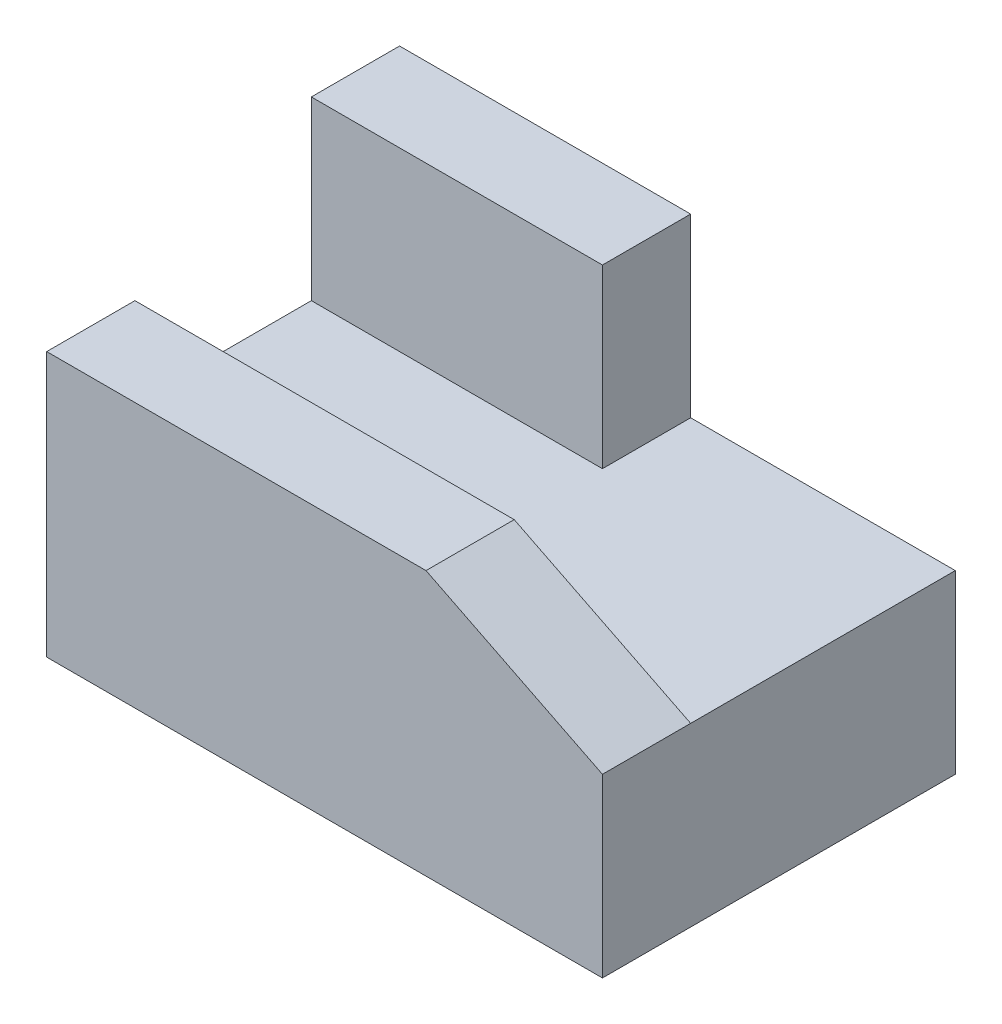
ISO-10303-21;
HEADER;
FILE_DESCRIPTION(('STEP AP214'),'2;1');
FILE_NAME('part.step','',(''),(''),'','','');
FILE_SCHEMA(('AUTOMOTIVE_DESIGN { 1 0 10303 214 1 1 1 1 }'));
ENDSEC;
DATA;
#1=APPLICATION_CONTEXT('core data for automotive mechanical design processes');
#2=APPLICATION_PROTOCOL_DEFINITION('international standard','automotive_design',2000,#1);
#3=PRODUCT_CONTEXT('',#1,'mechanical');
#4=PRODUCT('Part','Part','',(#3));
#5=PRODUCT_RELATED_PRODUCT_CATEGORY('part','',(#4));
#6=PRODUCT_DEFINITION_FORMATION('','',#4);
#7=PRODUCT_DEFINITION_CONTEXT('part definition',#1,'design');
#8=PRODUCT_DEFINITION('design','',#6,#7);
#9=PRODUCT_DEFINITION_SHAPE('','',#8);
#10=(LENGTH_UNIT() NAMED_UNIT(*) SI_UNIT(.MILLI.,.METRE.));
#11=(NAMED_UNIT(*) PLANE_ANGLE_UNIT() SI_UNIT($,.RADIAN.));
#12=(NAMED_UNIT(*) SI_UNIT($,.STERADIAN.) SOLID_ANGLE_UNIT());
#13=UNCERTAINTY_MEASURE_WITH_UNIT(LENGTH_MEASURE(1.E-05),#10,'distance_accuracy_value','');
#14=(GEOMETRIC_REPRESENTATION_CONTEXT(3) GLOBAL_UNCERTAINTY_ASSIGNED_CONTEXT((#13)) GLOBAL_UNIT_ASSIGNED_CONTEXT((#10,
#11,#12)) REPRESENTATION_CONTEXT('',''));
#15=CARTESIAN_POINT('',(0.,0.,0.));
#16=DIRECTION('',(0.,0.,1.));
#17=DIRECTION('',(1.,0.,0.));
#18=AXIS2_PLACEMENT_3D('',#15,#16,#17);
#19=CARTESIAN_POINT('',(63.,20.,0.));
#20=DIRECTION('',(-1.,0.,0.));
#21=DIRECTION('',(0.,0.,1.));
#22=AXIS2_PLACEMENT_3D('',#19,#20,#21);
#23=PLANE('',#22);
#24=DIRECTION('',(0.,0.,1.));
#25=VECTOR('',#24,1.);
#26=CARTESIAN_POINT('',(63.,20.,-128.337434303747));
#27=LINE('',#26,#25);
#28=CARTESIAN_POINT('',(63.,20.,-10.));
#29=VERTEX_POINT('',#28);
#30=CARTESIAN_POINT('',(63.,20.,0.));
#31=VERTEX_POINT('',#30);
#32=EDGE_CURVE('E118',#29,#31,#27,.T.);
#33=ORIENTED_EDGE('',*,*,#32,.T.);
#34=DIRECTION('',(0.,-1.,0.));
#35=VECTOR('',#34,1.);
#36=CARTESIAN_POINT('',(63.,30.,0.));
#37=LINE('',#36,#35);
#38=CARTESIAN_POINT('',(63.,0.,0.));
#39=VERTEX_POINT('',#38);
#40=EDGE_CURVE('E128',#31,#39,#37,.T.);
#41=ORIENTED_EDGE('',*,*,#40,.T.);
#42=DIRECTION('',(0.,0.,-1.));
#43=VECTOR('',#42,1.);
#44=CARTESIAN_POINT('',(63.,0.,0.));
#45=LINE('',#44,#43);
#46=CARTESIAN_POINT('',(63.,0.,-40.));
#47=VERTEX_POINT('',#46);
#48=EDGE_CURVE('E162',#39,#47,#45,.T.);
#49=ORIENTED_EDGE('',*,*,#48,.T.);
#50=DIRECTION('',(0.,-1.,0.));
#51=VECTOR('',#50,1.);
#52=CARTESIAN_POINT('',(63.,20.,-40.));
#53=LINE('',#52,#51);
#54=CARTESIAN_POINT('',(63.,20.,-40.));
#55=VERTEX_POINT('',#54);
#56=EDGE_CURVE('E11',#55,#47,#53,.T.);
#57=ORIENTED_EDGE('',*,*,#56,.F.);
#58=DIRECTION('',(0.,0.,-1.));
#59=VECTOR('',#58,1.);
#60=CARTESIAN_POINT('',(63.,20.,0.));
#61=LINE('',#60,#59);
#62=EDGE_CURVE('E61',#29,#55,#61,.T.);
#63=ORIENTED_EDGE('',*,*,#62,.F.);
#64=EDGE_LOOP('',(#33,#41,#49,#57,#63));
#65=FACE_BOUND('',#64,.T.);
#66=ADVANCED_FACE('F37',(#65),#23,.F.);
#67=CARTESIAN_POINT('',(0.,30.,-10.));
#68=DIRECTION('',(0.,0.,-1.));
#69=DIRECTION('',(-1.,0.,0.));
#70=AXIS2_PLACEMENT_3D('',#67,#68,#69);
#71=PLANE('',#70);
#72=DIRECTION('',(1.,0.,0.));
#73=VECTOR('',#72,1.);
#74=CARTESIAN_POINT('',(0.,30.,-10.));
#75=LINE('',#74,#73);
#76=CARTESIAN_POINT('',(0.,30.,-10.));
#77=VERTEX_POINT('',#76);
#78=CARTESIAN_POINT('',(43.,30.,-10.));
#79=VERTEX_POINT('',#78);
#80=EDGE_CURVE('E136',#77,#79,#75,.T.);
#81=ORIENTED_EDGE('',*,*,#80,.T.);
#82=DIRECTION('',(-0.894427190999916,0.447213595499958,0.));
#83=VECTOR('',#82,1.);
#84=CARTESIAN_POINT('',(63.,20.,-9.99999999999999));
#85=LINE('',#84,#83);
#86=EDGE_CURVE('E52',#29,#79,#85,.T.);
#87=ORIENTED_EDGE('',*,*,#86,.F.);
#88=DIRECTION('',(1.,0.,0.));
#89=VECTOR('',#88,1.);
#90=CARTESIAN_POINT('',(0.,20.,-10.));
#91=LINE('',#90,#89);
#92=CARTESIAN_POINT('',(0.,20.,-10.));
#93=VERTEX_POINT('',#92);
#94=EDGE_CURVE('E151',#93,#29,#91,.T.);
#95=ORIENTED_EDGE('',*,*,#94,.F.);
#96=DIRECTION('',(0.,-1.,0.));
#97=VECTOR('',#96,1.);
#98=CARTESIAN_POINT('',(0.,30.,-10.));
#99=LINE('',#98,#97);
#100=EDGE_CURVE('E144',#77,#93,#99,.T.);
#101=ORIENTED_EDGE('',*,*,#100,.F.);
#102=EDGE_LOOP('',(#81,#87,#95,#101));
#103=FACE_BOUND('',#102,.T.);
#104=ADVANCED_FACE('F190',(#103),#71,.T.);
#105=CARTESIAN_POINT('',(0.,30.,0.));
#106=DIRECTION('',(0.,1.,0.));
#107=DIRECTION('',(0.,0.,1.));
#108=AXIS2_PLACEMENT_3D('',#105,#106,#107);
#109=PLANE('',#108);
#110=DIRECTION('',(1.,0.,0.));
#111=VECTOR('',#110,1.);
#112=CARTESIAN_POINT('',(0.,30.,0.));
#113=LINE('',#112,#111);
#114=CARTESIAN_POINT('',(0.,30.,0.));
#115=VERTEX_POINT('',#114);
#116=CARTESIAN_POINT('',(43.,30.,0.));
#117=VERTEX_POINT('',#116);
#118=EDGE_CURVE('E125',#115,#117,#113,.T.);
#119=ORIENTED_EDGE('',*,*,#118,.T.);
#120=DIRECTION('',(0.,0.,1.));
#121=VECTOR('',#120,1.);
#122=CARTESIAN_POINT('',(43.,30.,-128.337434303747));
#123=LINE('',#122,#121);
#124=EDGE_CURVE('E109',#79,#117,#123,.T.);
#125=ORIENTED_EDGE('',*,*,#124,.F.);
#126=ORIENTED_EDGE('',*,*,#80,.F.);
#127=DIRECTION('',(0.,0.,-1.));
#128=VECTOR('',#127,1.);
#129=CARTESIAN_POINT('',(0.,30.,0.));
#130=LINE('',#129,#128);
#131=EDGE_CURVE('E132',#115,#77,#130,.T.);
#132=ORIENTED_EDGE('',*,*,#131,.F.);
#133=EDGE_LOOP('',(#119,#125,#126,#132));
#134=FACE_BOUND('',#133,.T.);
#135=ADVANCED_FACE('F130',(#134),#109,.T.);
#136=CARTESIAN_POINT('',(0.,20.,0.));
#137=DIRECTION('',(-1.,0.,0.));
#138=DIRECTION('',(0.,0.,1.));
#139=AXIS2_PLACEMENT_3D('',#136,#137,#138);
#140=PLANE('',#139);
#141=DIRECTION('',(0.,0.,-1.));
#142=VECTOR('',#141,1.);
#143=CARTESIAN_POINT('',(0.,0.,0.));
#144=LINE('',#143,#142);
#145=CARTESIAN_POINT('',(0.,0.,0.));
#146=VERTEX_POINT('',#145);
#147=CARTESIAN_POINT('',(0.,0.,-40.));
#148=VERTEX_POINT('',#147);
#149=EDGE_CURVE('E147',#146,#148,#144,.T.);
#150=ORIENTED_EDGE('',*,*,#149,.F.);
#151=DIRECTION('',(0.,-1.,0.));
#152=VECTOR('',#151,1.);
#153=CARTESIAN_POINT('',(0.,30.,0.));
#154=LINE('',#153,#152);
#155=EDGE_CURVE('E134',#115,#146,#154,.T.);
#156=ORIENTED_EDGE('',*,*,#155,.F.);
#157=ORIENTED_EDGE('',*,*,#131,.T.);
#158=ORIENTED_EDGE('',*,*,#100,.T.);
#159=DIRECTION('',(0.,0.,-1.));
#160=VECTOR('',#159,1.);
#161=CARTESIAN_POINT('',(0.,20.,0.));
#162=LINE('',#161,#160);
#163=CARTESIAN_POINT('',(0.,20.,-30.));
#164=VERTEX_POINT('',#163);
#165=EDGE_CURVE('E148',#93,#164,#162,.T.);
#166=ORIENTED_EDGE('',*,*,#165,.T.);
#167=DIRECTION('',(0.,-1.,0.));
#168=VECTOR('',#167,1.);
#169=CARTESIAN_POINT('',(0.,40.,-30.));
#170=LINE('',#169,#168);
#171=CARTESIAN_POINT('',(0.,40.,-30.));
#172=VERTEX_POINT('',#171);
#173=EDGE_CURVE('E181',#172,#164,#170,.T.);
#174=ORIENTED_EDGE('',*,*,#173,.F.);
#175=DIRECTION('',(0.,0.,-1.));
#176=VECTOR('',#175,1.);
#177=CARTESIAN_POINT('',(0.,40.,0.));
#178=LINE('',#177,#176);
#179=CARTESIAN_POINT('',(0.,40.,-40.));
#180=VERTEX_POINT('',#179);
#181=EDGE_CURVE('E179',#172,#180,#178,.T.);
#182=ORIENTED_EDGE('',*,*,#181,.T.);
#183=DIRECTION('',(0.,-1.,0.));
#184=VECTOR('',#183,1.);
#185=CARTESIAN_POINT('',(0.,40.,-40.));
#186=LINE('',#185,#184);
#187=EDGE_CURVE('E174',#180,#148,#186,.T.);
#188=ORIENTED_EDGE('',*,*,#187,.T.);
#189=EDGE_LOOP('',(#150,#156,#157,#158,#166,#174,#182,#188));
#190=FACE_BOUND('',#189,.T.);
#191=ADVANCED_FACE('F39',(#190),#140,.T.);
#192=CARTESIAN_POINT('',(0.,20.,-40.));
#193=DIRECTION('',(0.,0.,-1.));
#194=DIRECTION('',(-1.,0.,0.));
#195=AXIS2_PLACEMENT_3D('',#192,#193,#194);
#196=PLANE('',#195);
#197=DIRECTION('',(1.,0.,0.));
#198=VECTOR('',#197,1.);
#199=CARTESIAN_POINT('',(0.,0.,-40.));
#200=LINE('',#199,#198);
#201=EDGE_CURVE('E152',#148,#47,#200,.T.);
#202=ORIENTED_EDGE('',*,*,#201,.F.);
#203=ORIENTED_EDGE('',*,*,#187,.F.);
#204=DIRECTION('',(1.,0.,0.));
#205=VECTOR('',#204,1.);
#206=CARTESIAN_POINT('',(0.,40.,-40.));
#207=LINE('',#206,#205);
#208=CARTESIAN_POINT('',(33.,40.,-40.));
#209=VERTEX_POINT('',#208);
#210=EDGE_CURVE('E205',#180,#209,#207,.T.);
#211=ORIENTED_EDGE('',*,*,#210,.T.);
#212=DIRECTION('',(0.,-1.,0.));
#213=VECTOR('',#212,1.);
#214=CARTESIAN_POINT('',(33.,40.,-40.));
#215=LINE('',#214,#213);
#216=CARTESIAN_POINT('',(33.,20.,-40.));
#217=VERTEX_POINT('',#216);
#218=EDGE_CURVE('E180',#209,#217,#215,.T.);
#219=ORIENTED_EDGE('',*,*,#218,.T.);
#220=DIRECTION('',(1.,0.,0.));
#221=VECTOR('',#220,1.);
#222=CARTESIAN_POINT('',(0.,20.,-40.));
#223=LINE('',#222,#221);
#224=EDGE_CURVE('E155',#217,#55,#223,.T.);
#225=ORIENTED_EDGE('',*,*,#224,.T.);
#226=ORIENTED_EDGE('',*,*,#56,.T.);
#227=EDGE_LOOP('',(#202,#203,#211,#219,#225,#226));
#228=FACE_BOUND('',#227,.T.);
#229=ADVANCED_FACE('F172',(#228),#196,.T.);
#230=CARTESIAN_POINT('',(0.,20.,0.));
#231=DIRECTION('',(0.,1.,0.));
#232=DIRECTION('',(0.,0.,1.));
#233=AXIS2_PLACEMENT_3D('',#230,#231,#232);
#234=PLANE('',#233);
#235=ORIENTED_EDGE('',*,*,#165,.F.);
#236=ORIENTED_EDGE('',*,*,#94,.T.);
#237=ORIENTED_EDGE('',*,*,#62,.T.);
#238=ORIENTED_EDGE('',*,*,#224,.F.);
#239=DIRECTION('',(0.,0.,-1.));
#240=VECTOR('',#239,1.);
#241=CARTESIAN_POINT('',(33.,20.,0.));
#242=LINE('',#241,#240);
#243=CARTESIAN_POINT('',(33.,20.,-30.));
#244=VERTEX_POINT('',#243);
#245=EDGE_CURVE('E158',#244,#217,#242,.T.);
#246=ORIENTED_EDGE('',*,*,#245,.F.);
#247=DIRECTION('',(1.,0.,0.));
#248=VECTOR('',#247,1.);
#249=CARTESIAN_POINT('',(0.,20.,-30.));
#250=LINE('',#249,#248);
#251=EDGE_CURVE('E45',#164,#244,#250,.T.);
#252=ORIENTED_EDGE('',*,*,#251,.F.);
#253=EDGE_LOOP('',(#235,#236,#237,#238,#246,#252));
#254=FACE_BOUND('',#253,.T.);
#255=ADVANCED_FACE('F193',(#254),#234,.T.);
#256=CARTESIAN_POINT('',(0.,0.,0.));
#257=DIRECTION('',(0.,1.,0.));
#258=DIRECTION('',(0.,0.,1.));
#259=AXIS2_PLACEMENT_3D('',#256,#257,#258);
#260=PLANE('',#259);
#261=ORIENTED_EDGE('',*,*,#149,.T.);
#262=ORIENTED_EDGE('',*,*,#201,.T.);
#263=ORIENTED_EDGE('',*,*,#48,.F.);
#264=DIRECTION('',(1.,0.,0.));
#265=VECTOR('',#264,1.);
#266=CARTESIAN_POINT('',(0.,0.,0.));
#267=LINE('',#266,#265);
#268=EDGE_CURVE('E140',#146,#39,#267,.T.);
#269=ORIENTED_EDGE('',*,*,#268,.F.);
#270=EDGE_LOOP('',(#261,#262,#263,#269));
#271=FACE_BOUND('',#270,.T.);
#272=ADVANCED_FACE('F168',(#271),#260,.F.);
#273=CARTESIAN_POINT('',(0.,30.,0.));
#274=DIRECTION('',(0.,0.,-1.));
#275=DIRECTION('',(-1.,0.,0.));
#276=AXIS2_PLACEMENT_3D('',#273,#274,#275);
#277=PLANE('',#276);
#278=ORIENTED_EDGE('',*,*,#40,.F.);
#279=DIRECTION('',(-0.894427190999916,0.447213595499958,0.));
#280=VECTOR('',#279,1.);
#281=CARTESIAN_POINT('',(63.,20.,0.));
#282=LINE('',#281,#280);
#283=EDGE_CURVE('E112',#31,#117,#282,.T.);
#284=ORIENTED_EDGE('',*,*,#283,.T.);
#285=ORIENTED_EDGE('',*,*,#118,.F.);
#286=ORIENTED_EDGE('',*,*,#155,.T.);
#287=ORIENTED_EDGE('',*,*,#268,.T.);
#288=EDGE_LOOP('',(#278,#284,#285,#286,#287));
#289=FACE_BOUND('',#288,.T.);
#290=ADVANCED_FACE('F123',(#289),#277,.F.);
#291=CARTESIAN_POINT('',(0.,40.,-30.));
#292=DIRECTION('',(0.,0.,-1.));
#293=DIRECTION('',(-1.,0.,0.));
#294=AXIS2_PLACEMENT_3D('',#291,#292,#293);
#295=PLANE('',#294);
#296=ORIENTED_EDGE('',*,*,#251,.T.);
#297=DIRECTION('',(0.,-1.,0.));
#298=VECTOR('',#297,1.);
#299=CARTESIAN_POINT('',(33.,40.,-30.));
#300=LINE('',#299,#298);
#301=CARTESIAN_POINT('',(33.,40.,-30.));
#302=VERTEX_POINT('',#301);
#303=EDGE_CURVE('E141',#302,#244,#300,.T.);
#304=ORIENTED_EDGE('',*,*,#303,.F.);
#305=DIRECTION('',(1.,0.,0.));
#306=VECTOR('',#305,1.);
#307=CARTESIAN_POINT('',(0.,40.,-30.));
#308=LINE('',#307,#306);
#309=EDGE_CURVE('E206',#172,#302,#308,.T.);
#310=ORIENTED_EDGE('',*,*,#309,.F.);
#311=ORIENTED_EDGE('',*,*,#173,.T.);
#312=EDGE_LOOP('',(#296,#304,#310,#311));
#313=FACE_BOUND('',#312,.T.);
#314=ADVANCED_FACE('F197',(#313),#295,.F.);
#315=CARTESIAN_POINT('',(33.,40.,0.));
#316=DIRECTION('',(-1.,0.,0.));
#317=DIRECTION('',(0.,0.,1.));
#318=AXIS2_PLACEMENT_3D('',#315,#316,#317);
#319=PLANE('',#318);
#320=ORIENTED_EDGE('',*,*,#245,.T.);
#321=ORIENTED_EDGE('',*,*,#218,.F.);
#322=DIRECTION('',(0.,0.,-1.));
#323=VECTOR('',#322,1.);
#324=CARTESIAN_POINT('',(33.,40.,0.));
#325=LINE('',#324,#323);
#326=EDGE_CURVE('E202',#302,#209,#325,.T.);
#327=ORIENTED_EDGE('',*,*,#326,.F.);
#328=ORIENTED_EDGE('',*,*,#303,.T.);
#329=EDGE_LOOP('',(#320,#321,#327,#328));
#330=FACE_BOUND('',#329,.T.);
#331=ADVANCED_FACE('F200',(#330),#319,.F.);
#332=CARTESIAN_POINT('',(0.,40.,0.));
#333=DIRECTION('',(0.,1.,0.));
#334=DIRECTION('',(0.,0.,1.));
#335=AXIS2_PLACEMENT_3D('',#332,#333,#334);
#336=PLANE('',#335);
#337=ORIENTED_EDGE('',*,*,#309,.T.);
#338=ORIENTED_EDGE('',*,*,#326,.T.);
#339=ORIENTED_EDGE('',*,*,#210,.F.);
#340=ORIENTED_EDGE('',*,*,#181,.F.);
#341=EDGE_LOOP('',(#337,#338,#339,#340));
#342=FACE_BOUND('',#341,.T.);
#343=ADVANCED_FACE('F208',(#342),#336,.T.);
#344=CARTESIAN_POINT('',(63.,20.,-128.337434303747));
#345=DIRECTION('',(0.447213595499958,0.894427190999916,0.));
#346=DIRECTION('',(-0.894427190999916,0.447213595499958,0.));
#347=AXIS2_PLACEMENT_3D('',#344,#345,#346);
#348=PLANE('',#347);
#349=ORIENTED_EDGE('',*,*,#32,.F.);
#350=ORIENTED_EDGE('',*,*,#86,.T.);
#351=ORIENTED_EDGE('',*,*,#124,.T.);
#352=ORIENTED_EDGE('',*,*,#283,.F.);
#353=EDGE_LOOP('',(#349,#350,#351,#352));
#354=FACE_BOUND('',#353,.T.);
#355=ADVANCED_FACE('F111',(#354),#348,.T.);
#356=CLOSED_SHELL('',(#66,#104,#135,#191,#229,#255,#272,#290,#314,#331,#343,#355));
#357=MANIFOLD_SOLID_BREP('B2',#356);
#358=ADVANCED_BREP_SHAPE_REPRESENTATION('',(#18,#357),#14);
#359=SHAPE_DEFINITION_REPRESENTATION(#9,#358);
ENDSEC;
END-ISO-10303-21;
